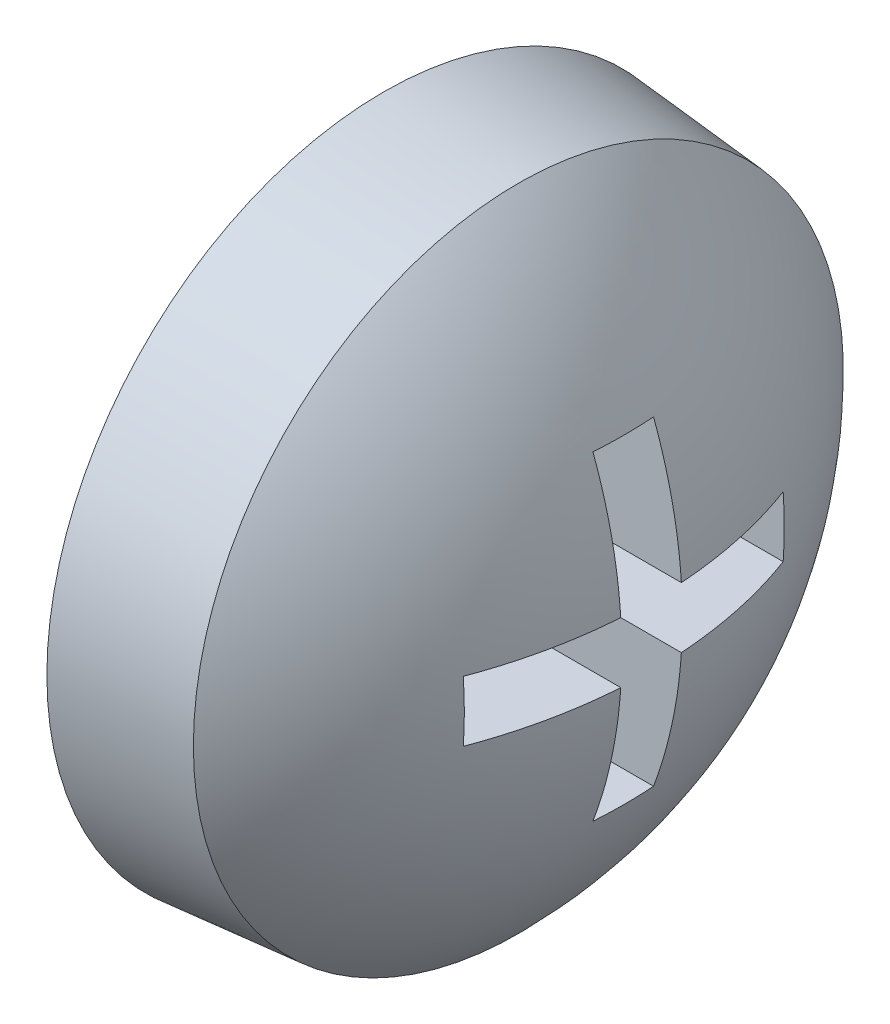
ISO-10303-21;
HEADER;
FILE_DESCRIPTION(('STEP AP214'),'2;1');
FILE_NAME('part.step','',(''),(''),'','','');
FILE_SCHEMA(('AUTOMOTIVE_DESIGN { 1 0 10303 214 1 1 1 1 }'));
ENDSEC;
DATA;
#1=APPLICATION_CONTEXT('core data for automotive mechanical design processes');
#2=APPLICATION_PROTOCOL_DEFINITION('international standard','automotive_design',2000,#1);
#3=PRODUCT_CONTEXT('',#1,'mechanical');
#4=PRODUCT('Part','Part','',(#3));
#5=PRODUCT_RELATED_PRODUCT_CATEGORY('part','',(#4));
#6=PRODUCT_DEFINITION_FORMATION('','',#4);
#7=PRODUCT_DEFINITION_CONTEXT('part definition',#1,'design');
#8=PRODUCT_DEFINITION('design','',#6,#7);
#9=PRODUCT_DEFINITION_SHAPE('','',#8);
#10=(LENGTH_UNIT() NAMED_UNIT(*) SI_UNIT(.MILLI.,.METRE.));
#11=(NAMED_UNIT(*) PLANE_ANGLE_UNIT() SI_UNIT($,.RADIAN.));
#12=(NAMED_UNIT(*) SI_UNIT($,.STERADIAN.) SOLID_ANGLE_UNIT());
#13=UNCERTAINTY_MEASURE_WITH_UNIT(LENGTH_MEASURE(1.E-05),#10,'distance_accuracy_value','');
#14=(GEOMETRIC_REPRESENTATION_CONTEXT(3) GLOBAL_UNCERTAINTY_ASSIGNED_CONTEXT((#13)) GLOBAL_UNIT_ASSIGNED_CONTEXT((#10,
#11,#12)) REPRESENTATION_CONTEXT('',''));
#15=CARTESIAN_POINT('',(0.,0.,0.));
#16=DIRECTION('',(0.,0.,1.));
#17=DIRECTION('',(1.,0.,0.));
#18=AXIS2_PLACEMENT_3D('',#15,#16,#17);
#19=CARTESIAN_POINT('',(215.733333333333,-6.9,10.));
#20=DIRECTION('',(1.,0.,0.));
#21=DIRECTION('',(0.,0.,-1.));
#22=AXIS2_PLACEMENT_3D('',#19,#20,#21);
#23=PLANE('',#22);
#24=DIRECTION('',(0.,0.,1.));
#25=VECTOR('',#24,1.);
#26=CARTESIAN_POINT('',(215.733333333333,-7.85,10.));
#27=LINE('',#26,#25);
#28=CARTESIAN_POINT('',(215.733333333333,-7.85,9.82));
#29=VERTEX_POINT('',#28);
#30=CARTESIAN_POINT('',(215.733333333333,-7.85,10.18));
#31=VERTEX_POINT('',#30);
#32=EDGE_CURVE('E293',#29,#31,#27,.T.);
#33=ORIENTED_EDGE('',*,*,#32,.F.);
#34=DIRECTION('',(0.,1.,0.));
#35=VECTOR('',#34,1.);
#36=CARTESIAN_POINT('',(215.733333333333,-6.9,9.82));
#37=LINE('',#36,#35);
#38=CARTESIAN_POINT('',(215.733333333333,-7.08,9.82));
#39=VERTEX_POINT('',#38);
#40=EDGE_CURVE('E298',#39,#29,#37,.F.);
#41=ORIENTED_EDGE('',*,*,#40,.F.);
#42=DIRECTION('',(0.,0.,1.));
#43=VECTOR('',#42,1.);
#44=CARTESIAN_POINT('',(215.733333333333,-7.08,10.));
#45=LINE('',#44,#43);
#46=CARTESIAN_POINT('',(215.733333333333,-7.08,9.05));
#47=VERTEX_POINT('',#46);
#48=EDGE_CURVE('E303',#47,#39,#45,.T.);
#49=ORIENTED_EDGE('',*,*,#48,.F.);
#50=DIRECTION('',(0.,1.,0.));
#51=VECTOR('',#50,1.);
#52=CARTESIAN_POINT('',(215.733333333333,-6.9,9.05));
#53=LINE('',#52,#51);
#54=CARTESIAN_POINT('',(215.733333333333,-6.72,9.05));
#55=VERTEX_POINT('',#54);
#56=EDGE_CURVE('E308',#55,#47,#53,.F.);
#57=ORIENTED_EDGE('',*,*,#56,.F.);
#58=DIRECTION('',(0.,0.,-1.));
#59=VECTOR('',#58,1.);
#60=CARTESIAN_POINT('',(215.733333333333,-6.72,10.));
#61=LINE('',#60,#59);
#62=CARTESIAN_POINT('',(215.733333333333,-6.72,9.82));
#63=VERTEX_POINT('',#62);
#64=EDGE_CURVE('E313',#63,#55,#61,.T.);
#65=ORIENTED_EDGE('',*,*,#64,.F.);
#66=DIRECTION('',(0.,1.,0.));
#67=VECTOR('',#66,1.);
#68=CARTESIAN_POINT('',(215.733333333333,-6.9,9.82));
#69=LINE('',#68,#67);
#70=CARTESIAN_POINT('',(215.733333333333,-5.95,9.82));
#71=VERTEX_POINT('',#70);
#72=EDGE_CURVE('E318',#71,#63,#69,.F.);
#73=ORIENTED_EDGE('',*,*,#72,.F.);
#74=DIRECTION('',(0.,0.,1.));
#75=VECTOR('',#74,1.);
#76=CARTESIAN_POINT('',(215.733333333333,-5.95,10.));
#77=LINE('',#76,#75);
#78=CARTESIAN_POINT('',(215.733333333333,-5.95,10.18));
#79=VERTEX_POINT('',#78);
#80=EDGE_CURVE('E267',#71,#79,#77,.T.);
#81=ORIENTED_EDGE('',*,*,#80,.T.);
#82=DIRECTION('',(0.,1.,0.));
#83=VECTOR('',#82,1.);
#84=CARTESIAN_POINT('',(215.733333333333,-6.9,10.18));
#85=LINE('',#84,#83);
#86=CARTESIAN_POINT('',(215.733333333333,-6.72,10.18));
#87=VERTEX_POINT('',#86);
#88=EDGE_CURVE('E264',#87,#79,#85,.T.);
#89=ORIENTED_EDGE('',*,*,#88,.F.);
#90=DIRECTION('',(0.,0.,-1.));
#91=VECTOR('',#90,1.);
#92=CARTESIAN_POINT('',(215.733333333333,-6.72,10.));
#93=LINE('',#92,#91);
#94=CARTESIAN_POINT('',(215.733333333333,-6.72,10.95));
#95=VERTEX_POINT('',#94);
#96=EDGE_CURVE('E260',#95,#87,#93,.T.);
#97=ORIENTED_EDGE('',*,*,#96,.F.);
#98=DIRECTION('',(0.,1.,0.));
#99=VECTOR('',#98,1.);
#100=CARTESIAN_POINT('',(215.733333333333,-6.9,10.95));
#101=LINE('',#100,#99);
#102=CARTESIAN_POINT('',(215.733333333333,-7.08,10.95));
#103=VERTEX_POINT('',#102);
#104=EDGE_CURVE('E231',#95,#103,#101,.F.);
#105=ORIENTED_EDGE('',*,*,#104,.T.);
#106=DIRECTION('',(0.,0.,1.));
#107=VECTOR('',#106,1.);
#108=CARTESIAN_POINT('',(215.733333333333,-7.08,10.));
#109=LINE('',#108,#107);
#110=CARTESIAN_POINT('',(215.733333333333,-7.08,10.18));
#111=VERTEX_POINT('',#110);
#112=EDGE_CURVE('E278',#111,#103,#109,.T.);
#113=ORIENTED_EDGE('',*,*,#112,.F.);
#114=DIRECTION('',(0.,1.,0.));
#115=VECTOR('',#114,1.);
#116=CARTESIAN_POINT('',(215.733333333333,-6.9,10.18));
#117=LINE('',#116,#115);
#118=EDGE_CURVE('E288',#31,#111,#117,.T.);
#119=ORIENTED_EDGE('',*,*,#118,.F.);
#120=EDGE_LOOP('',(#33,#41,#49,#57,#65,#73,#81,#89,#97,#105,#113,#119));
#121=FACE_BOUND('',#120,.T.);
#122=ADVANCED_FACE('F17',(#121),#23,.T.);
#123=CARTESIAN_POINT('',(216.333333333333,-6.72,10.));
#124=DIRECTION('',(0.,-1.,0.));
#125=DIRECTION('',(0.,0.,-1.));
#126=AXIS2_PLACEMENT_3D('',#123,#124,#125);
#127=PLANE('',#126);
#128=DIRECTION('',(1.,0.,0.));
#129=VECTOR('',#128,1.);
#130=CARTESIAN_POINT('',(216.333333333333,-6.72,10.95));
#131=LINE('',#130,#129);
#132=CARTESIAN_POINT('',(216.756237856524,-6.72,10.9500000000001));
#133=VERTEX_POINT('',#132);
#134=EDGE_CURVE('E89',#133,#95,#131,.F.);
#135=ORIENTED_EDGE('',*,*,#134,.T.);
#136=ORIENTED_EDGE('',*,*,#96,.T.);
#137=DIRECTION('',(-1.,0.,0.));
#138=VECTOR('',#137,1.);
#139=CARTESIAN_POINT('',(216.333333333333,-6.72,10.18));
#140=LINE('',#139,#138);
#141=CARTESIAN_POINT('',(216.921430903127,-6.71999999999999,10.18));
#142=VERTEX_POINT('',#141);
#143=EDGE_CURVE('E224',#142,#87,#140,.T.);
#144=ORIENTED_EDGE('',*,*,#143,.F.);
#145=CARTESIAN_POINT('',(216.756237856524,-6.72,10.9500000000001));
#146=CARTESIAN_POINT('',(216.767782870718,-6.72,10.9189995540507));
#147=CARTESIAN_POINT('',(216.778762253102,-6.72,10.8877884938069));
#148=CARTESIAN_POINT('',(216.79953545164,-6.72,10.825110453647));
#149=CARTESIAN_POINT('',(216.809333758651,-6.72,10.7936449620742));
#150=CARTESIAN_POINT('',(216.827757299291,-6.72,10.7304618501357));
#151=CARTESIAN_POINT('',(216.83638553892,-6.72,10.6987451062673));
#152=CARTESIAN_POINT('',(216.852477288087,-6.72,10.6350619663156));
#153=CARTESIAN_POINT('',(216.859942316909,-6.72,10.6030959541243));
#154=CARTESIAN_POINT('',(216.873711495295,-6.72,10.5389148788569));
#155=CARTESIAN_POINT('',(216.88001564486,-6.72,10.5066998157809));
#156=CARTESIAN_POINT('',(216.891462392226,-6.72,10.4420201537525));
#157=CARTESIAN_POINT('',(216.896603446971,-6.72,10.4095552817086));
#158=CARTESIAN_POINT('',(216.905718495644,-6.72,10.3443751591894));
#159=CARTESIAN_POINT('',(216.909689388573,-6.72,10.3116594750373));
#160=CARTESIAN_POINT('',(216.916454375482,-6.72,10.2459761632456));
#161=CARTESIAN_POINT('',(216.919243763301,-6.72,10.2130080508538));
#162=CARTESIAN_POINT('',(216.921430903127,-6.72,10.18));
#163=B_SPLINE_CURVE_WITH_KNOTS('',3,(#145,#146,#147,#148,#149,#150,#151,#152,#153,#154,#155,
#156,#157,#158,#159,#160,#161,#162),.UNSPECIFIED.,.F.,.F.,(4,2,2,2,2,2,2,2,4),(0.,
0.0992357442434492,0.198081387639303,0.296668072480549,0.395124892694158,0.49358171290778,
0.592168397749024,0.691014041144897,0.790249785388334),.UNSPECIFIED.);
#164=EDGE_CURVE('E20',#133,#142,#163,.T.);
#165=ORIENTED_EDGE('',*,*,#164,.F.);
#166=EDGE_LOOP('',(#135,#136,#144,#165));
#167=FACE_BOUND('',#166,.T.);
#168=ADVANCED_FACE('F221',(#167),#127,.T.);
#169=CARTESIAN_POINT('',(216.333333333333,-6.9,10.18));
#170=DIRECTION('',(0.,0.,-1.));
#171=DIRECTION('',(-1.,0.,0.));
#172=AXIS2_PLACEMENT_3D('',#169,#170,#171);
#173=PLANE('',#172);
#174=ORIENTED_EDGE('',*,*,#88,.T.);
#175=DIRECTION('',(1.,0.,0.));
#176=VECTOR('',#175,1.);
#177=CARTESIAN_POINT('',(216.333333333333,-5.95,10.18));
#178=LINE('',#177,#176);
#179=CARTESIAN_POINT('',(216.756237856524,-5.95,10.18));
#180=VERTEX_POINT('',#179);
#181=EDGE_CURVE('E324',#79,#180,#178,.T.);
#182=ORIENTED_EDGE('',*,*,#181,.T.);
#183=CARTESIAN_POINT('',(216.921430903127,-6.71999999999997,10.18));
#184=CARTESIAN_POINT('',(216.915776724439,-6.63440991744415,10.18));
#185=CARTESIAN_POINT('',(216.906045237038,-6.54909652262228,10.18));
#186=CARTESIAN_POINT('',(216.878678119522,-6.38034093840227,10.18));
#187=CARTESIAN_POINT('',(216.861096565483,-6.296889980518,10.18));
#188=CARTESIAN_POINT('',(216.816367435921,-6.12495750840946,10.18));
#189=CARTESIAN_POINT('',(216.788531372825,-6.03665468899643,10.18));
#190=CARTESIAN_POINT('',(216.756237856524,-5.94999999999986,10.18));
#191=B_SPLINE_CURVE_WITH_KNOTS('',3,(#183,#184,#185,#186,#187,#188,#189,#190),.UNSPECIFIED.,.F.,
.F.,(4,2,2,4),(0.,0.25722165882936,0.512698117737386,0.789983486231737),.UNSPECIFIED.);
#192=EDGE_CURVE('E213',#142,#180,#191,.T.);
#193=ORIENTED_EDGE('',*,*,#192,.F.);
#194=ORIENTED_EDGE('',*,*,#143,.T.);
#195=EDGE_LOOP('',(#174,#182,#193,#194));
#196=FACE_BOUND('',#195,.T.);
#197=ADVANCED_FACE('F204',(#196),#173,.T.);
#198=CARTESIAN_POINT('',(216.333333333333,-5.95,10.));
#199=DIRECTION('',(0.,1.,0.));
#200=DIRECTION('',(0.,0.,1.));
#201=AXIS2_PLACEMENT_3D('',#198,#199,#200);
#202=PLANE('',#201);
#203=ORIENTED_EDGE('',*,*,#181,.F.);
#204=ORIENTED_EDGE('',*,*,#80,.F.);
#205=DIRECTION('',(1.,0.,0.));
#206=VECTOR('',#205,1.);
#207=CARTESIAN_POINT('',(216.333333333333,-5.95,9.82));
#208=LINE('',#207,#206);
#209=CARTESIAN_POINT('',(216.756237856524,-5.94999999999993,9.82));
#210=VERTEX_POINT('',#209);
#211=EDGE_CURVE('E320',#210,#71,#208,.F.);
#212=ORIENTED_EDGE('',*,*,#211,.F.);
#213=CARTESIAN_POINT('',(216.756237856524,-5.95,10.18));
#214=CARTESIAN_POINT('',(216.760466252223,-5.94999999999998,10.12));
#215=CARTESIAN_POINT('',(216.762580450072,-5.94999999999998,10.06));
#216=CARTESIAN_POINT('',(216.762580450072,-5.95000000000002,9.93999999999995));
#217=CARTESIAN_POINT('',(216.760466252223,-5.95000000000006,9.87999999999993));
#218=CARTESIAN_POINT('',(216.756237856524,-5.95000000000011,9.81999999999991));
#219=B_SPLINE_CURVE_WITH_KNOTS('',3,(#213,#214,#215,#216,#217,#218),.UNSPECIFIED.,.F.,.F.,(4,2,
4),(0.,0.180111711148749,0.360223422297499),.UNSPECIFIED.);
#220=EDGE_CURVE('E207',#180,#210,#219,.T.);
#221=ORIENTED_EDGE('',*,*,#220,.F.);
#222=EDGE_LOOP('',(#203,#204,#212,#221));
#223=FACE_BOUND('',#222,.T.);
#224=ADVANCED_FACE('F199',(#223),#202,.F.);
#225=CARTESIAN_POINT('',(216.333333333333,-6.9,9.82));
#226=DIRECTION('',(0.,0.,1.));
#227=DIRECTION('',(1.,0.,0.));
#228=AXIS2_PLACEMENT_3D('',#225,#226,#227);
#229=PLANE('',#228);
#230=ORIENTED_EDGE('',*,*,#72,.T.);
#231=DIRECTION('',(1.,0.,0.));
#232=VECTOR('',#231,1.);
#233=CARTESIAN_POINT('',(216.333333333333,-6.72,9.82));
#234=LINE('',#233,#232);
#235=CARTESIAN_POINT('',(216.921430903127,-6.72,9.81999999999999));
#236=VERTEX_POINT('',#235);
#237=EDGE_CURVE('E315',#236,#63,#234,.F.);
#238=ORIENTED_EDGE('',*,*,#237,.F.);
#239=CARTESIAN_POINT('',(216.756237856524,-5.94999999999985,9.82));
#240=CARTESIAN_POINT('',(216.767782870718,-5.98100044594928,9.82));
#241=CARTESIAN_POINT('',(216.778762253102,-6.01221150619315,9.82));
#242=CARTESIAN_POINT('',(216.79953545164,-6.07488954635304,9.82));
#243=CARTESIAN_POINT('',(216.809333758651,-6.10635503792583,9.82));
#244=CARTESIAN_POINT('',(216.827757299291,-6.16953814986429,9.82));
#245=CARTESIAN_POINT('',(216.83638553892,-6.20125489373265,9.82));
#246=CARTESIAN_POINT('',(216.852477288087,-6.2649380336844,9.82));
#247=CARTESIAN_POINT('',(216.859942316909,-6.29690404587572,9.82));
#248=CARTESIAN_POINT('',(216.873711495295,-6.36108512114308,9.82));
#249=CARTESIAN_POINT('',(216.88001564486,-6.39330018421912,9.82));
#250=CARTESIAN_POINT('',(216.891462392226,-6.45797984624754,9.82));
#251=CARTESIAN_POINT('',(216.896603446971,-6.49044471829137,9.82));
#252=CARTESIAN_POINT('',(216.905718495644,-6.55562484081063,9.82));
#253=CARTESIAN_POINT('',(216.909689388573,-6.58834052496273,9.82));
#254=CARTESIAN_POINT('',(216.916454375482,-6.65402383675436,9.82));
#255=CARTESIAN_POINT('',(216.919243763301,-6.68699194914619,9.82));
#256=CARTESIAN_POINT('',(216.921430903127,-6.71999999999998,9.82));
#257=B_SPLINE_CURVE_WITH_KNOTS('',3,(#239,#240,#241,#242,#243,#244,#245,#246,#247,#248,#249,
#250,#251,#252,#253,#254,#255,#256),.UNSPECIFIED.,.F.,.F.,(4,2,2,2,2,2,2,2,4),(0.,
0.0992357442434457,0.198081387639302,0.296668072480548,0.395124892694157,0.493581712907779,
0.592168397749023,0.691014041144896,0.790249785388332),.UNSPECIFIED.);
#258=EDGE_CURVE('E184',#210,#236,#257,.T.);
#259=ORIENTED_EDGE('',*,*,#258,.F.);
#260=ORIENTED_EDGE('',*,*,#211,.T.);
#261=EDGE_LOOP('',(#230,#238,#259,#260));
#262=FACE_BOUND('',#261,.T.);
#263=ADVANCED_FACE('F194',(#262),#229,.T.);
#264=CARTESIAN_POINT('',(216.333333333333,-6.72,10.));
#265=DIRECTION('',(0.,-1.,0.));
#266=DIRECTION('',(0.,0.,-1.));
#267=AXIS2_PLACEMENT_3D('',#264,#265,#266);
#268=PLANE('',#267);
#269=DIRECTION('',(1.,0.,0.));
#270=VECTOR('',#269,1.);
#271=CARTESIAN_POINT('',(216.333333333333,-6.72,9.05));
#272=LINE('',#271,#270);
#273=CARTESIAN_POINT('',(216.756237856524,-6.72,9.05));
#274=VERTEX_POINT('',#273);
#275=EDGE_CURVE('E310',#274,#55,#272,.F.);
#276=ORIENTED_EDGE('',*,*,#275,.F.);
#277=CARTESIAN_POINT('',(216.921430903127,-6.72,9.81999999999998));
#278=CARTESIAN_POINT('',(216.915776724439,-6.72,9.73440991744416));
#279=CARTESIAN_POINT('',(216.906045237038,-6.72,9.64909652262228));
#280=CARTESIAN_POINT('',(216.878678119522,-6.72,9.48034093840228));
#281=CARTESIAN_POINT('',(216.861096565483,-6.72,9.396889980518));
#282=CARTESIAN_POINT('',(216.816367435921,-6.72,9.22495750840947));
#283=CARTESIAN_POINT('',(216.788531372825,-6.72,9.13665468899643));
#284=CARTESIAN_POINT('',(216.756237856524,-6.72,9.04999999999986));
#285=B_SPLINE_CURVE_WITH_KNOTS('',3,(#277,#278,#279,#280,#281,#282,#283,#284),.UNSPECIFIED.,.F.,
.F.,(4,2,2,4),(0.,0.257221658829358,0.512698117737381,0.789983486231737),.UNSPECIFIED.);
#286=EDGE_CURVE('E176',#236,#274,#285,.T.);
#287=ORIENTED_EDGE('',*,*,#286,.F.);
#288=ORIENTED_EDGE('',*,*,#237,.T.);
#289=ORIENTED_EDGE('',*,*,#64,.T.);
#290=EDGE_LOOP('',(#276,#287,#288,#289));
#291=FACE_BOUND('',#290,.T.);
#292=ADVANCED_FACE('F191',(#291),#268,.T.);
#293=CARTESIAN_POINT('',(216.333333333333,-6.9,9.05));
#294=DIRECTION('',(0.,0.,1.));
#295=DIRECTION('',(1.,0.,0.));
#296=AXIS2_PLACEMENT_3D('',#293,#294,#295);
#297=PLANE('',#296);
#298=DIRECTION('',(1.,0.,0.));
#299=VECTOR('',#298,1.);
#300=CARTESIAN_POINT('',(216.333333333333,-7.08,9.05));
#301=LINE('',#300,#299);
#302=CARTESIAN_POINT('',(216.756237856524,-7.08,9.04999999999993));
#303=VERTEX_POINT('',#302);
#304=EDGE_CURVE('E305',#303,#47,#301,.F.);
#305=ORIENTED_EDGE('',*,*,#304,.F.);
#306=CARTESIAN_POINT('',(216.756237856524,-7.08,9.05));
#307=CARTESIAN_POINT('',(216.762580450072,-6.99011174581231,9.05));
#308=CARTESIAN_POINT('',(216.762580450072,-6.9,9.05));
#309=B_SPLINE_CURVE_WITH_KNOTS('',2,(#306,#307,#308),.UNSPECIFIED.,.F.,.F.,(3,3),(0.,1.),.UNSPECIFIED.);
#310=CARTESIAN_POINT('',(216.762580450072,-6.9,9.05));
#311=VERTEX_POINT('',#310);
#312=EDGE_CURVE('E175',#311,#303,#309,.F.);
#313=ORIENTED_EDGE('',*,*,#312,.F.);
#314=CARTESIAN_POINT('',(216.762580450072,-6.9,9.05));
#315=CARTESIAN_POINT('',(216.762580450072,-6.80988825418735,9.05));
#316=CARTESIAN_POINT('',(216.756237856524,-6.72,9.05));
#317=B_SPLINE_CURVE_WITH_KNOTS('',2,(#314,#315,#316),.UNSPECIFIED.,.F.,.F.,(3,3),(0.,1.),.UNSPECIFIED.);
#318=EDGE_CURVE('E183',#274,#311,#317,.F.);
#319=ORIENTED_EDGE('',*,*,#318,.F.);
#320=ORIENTED_EDGE('',*,*,#275,.T.);
#321=ORIENTED_EDGE('',*,*,#56,.T.);
#322=EDGE_LOOP('',(#305,#313,#319,#320,#321));
#323=FACE_BOUND('',#322,.T.);
#324=ADVANCED_FACE('F164',(#323),#297,.T.);
#325=CARTESIAN_POINT('',(216.333333333333,-7.08,10.));
#326=DIRECTION('',(0.,1.,0.));
#327=DIRECTION('',(0.,0.,1.));
#328=AXIS2_PLACEMENT_3D('',#325,#326,#327);
#329=PLANE('',#328);
#330=ORIENTED_EDGE('',*,*,#304,.T.);
#331=ORIENTED_EDGE('',*,*,#48,.T.);
#332=DIRECTION('',(1.,0.,0.));
#333=VECTOR('',#332,1.);
#334=CARTESIAN_POINT('',(216.333333333333,-7.08,9.82));
#335=LINE('',#334,#333);
#336=CARTESIAN_POINT('',(216.921430903127,-7.08000000000001,9.82));
#337=VERTEX_POINT('',#336);
#338=EDGE_CURVE('E300',#337,#39,#335,.F.);
#339=ORIENTED_EDGE('',*,*,#338,.F.);
#340=CARTESIAN_POINT('',(216.756237856524,-7.08,9.04999999999985));
#341=CARTESIAN_POINT('',(216.767782870718,-7.08,9.08100044594927));
#342=CARTESIAN_POINT('',(216.778762253102,-7.08,9.11221150619314));
#343=CARTESIAN_POINT('',(216.79953545164,-7.08,9.17488954635303));
#344=CARTESIAN_POINT('',(216.809333758651,-7.08,9.20635503792583));
#345=CARTESIAN_POINT('',(216.827757299291,-7.08,9.26953814986429));
#346=CARTESIAN_POINT('',(216.83638553892,-7.08,9.30125489373265));
#347=CARTESIAN_POINT('',(216.852477288087,-7.08,9.3649380336844));
#348=CARTESIAN_POINT('',(216.859942316909,-7.08,9.39690404587572));
#349=CARTESIAN_POINT('',(216.873711495295,-7.08,9.46108512114308));
#350=CARTESIAN_POINT('',(216.88001564486,-7.08,9.49330018421912));
#351=CARTESIAN_POINT('',(216.891462392226,-7.08,9.55797984624754));
#352=CARTESIAN_POINT('',(216.896603446971,-7.08,9.59044471829137));
#353=CARTESIAN_POINT('',(216.905718495644,-7.08,9.65562484081063));
#354=CARTESIAN_POINT('',(216.909689388573,-7.08,9.68834052496273));
#355=CARTESIAN_POINT('',(216.916454375482,-7.08,9.75402383675436));
#356=CARTESIAN_POINT('',(216.919243763301,-7.08,9.78699194914619));
#357=CARTESIAN_POINT('',(216.921430903127,-7.08,9.81999999999998));
#358=B_SPLINE_CURVE_WITH_KNOTS('',3,(#340,#341,#342,#343,#344,#345,#346,#347,#348,#349,#350,
#351,#352,#353,#354,#355,#356,#357),.UNSPECIFIED.,.F.,.F.,(4,2,2,2,2,2,2,2,4),(0.,
0.0992357442434492,0.198081387639303,0.296668072480552,0.395124892694159,0.493581712907782,
0.592168397749026,0.691014041144899,0.790249785388335),.UNSPECIFIED.);
#359=EDGE_CURVE('E168',#303,#337,#358,.T.);
#360=ORIENTED_EDGE('',*,*,#359,.F.);
#361=EDGE_LOOP('',(#330,#331,#339,#360));
#362=FACE_BOUND('',#361,.T.);
#363=ADVANCED_FACE('F159',(#362),#329,.T.);
#364=CARTESIAN_POINT('',(216.333333333333,-6.9,9.82));
#365=DIRECTION('',(0.,0.,1.));
#366=DIRECTION('',(1.,0.,0.));
#367=AXIS2_PLACEMENT_3D('',#364,#365,#366);
#368=PLANE('',#367);
#369=ORIENTED_EDGE('',*,*,#40,.T.);
#370=DIRECTION('',(1.,0.,0.));
#371=VECTOR('',#370,1.);
#372=CARTESIAN_POINT('',(216.333333333333,-7.85,9.82));
#373=LINE('',#372,#371);
#374=CARTESIAN_POINT('',(216.756237856524,-7.85,9.81999999999998));
#375=VERTEX_POINT('',#374);
#376=EDGE_CURVE('E295',#375,#29,#373,.F.);
#377=ORIENTED_EDGE('',*,*,#376,.F.);
#378=CARTESIAN_POINT('',(216.921430903127,-7.08000000000002,9.82));
#379=CARTESIAN_POINT('',(216.915776724439,-7.16559008255585,9.82));
#380=CARTESIAN_POINT('',(216.906045237038,-7.25090347737772,9.82));
#381=CARTESIAN_POINT('',(216.878678119522,-7.41965906159773,9.82));
#382=CARTESIAN_POINT('',(216.861096565483,-7.503110019482,9.82));
#383=CARTESIAN_POINT('',(216.816367435921,-7.67504249159054,9.82));
#384=CARTESIAN_POINT('',(216.788531372825,-7.76334531100357,9.82));
#385=CARTESIAN_POINT('',(216.756237856524,-7.85000000000014,9.82));
#386=B_SPLINE_CURVE_WITH_KNOTS('',3,(#378,#379,#380,#381,#382,#383,#384,#385),.UNSPECIFIED.,.F.,
.F.,(4,2,2,4),(0.,0.257221658829359,0.512698117737383,0.789983486231734),.UNSPECIFIED.);
#387=EDGE_CURVE('E144',#337,#375,#386,.T.);
#388=ORIENTED_EDGE('',*,*,#387,.F.);
#389=ORIENTED_EDGE('',*,*,#338,.T.);
#390=EDGE_LOOP('',(#369,#377,#388,#389));
#391=FACE_BOUND('',#390,.T.);
#392=ADVANCED_FACE('F154',(#391),#368,.T.);
#393=CARTESIAN_POINT('',(216.333333333333,-7.85,10.));
#394=DIRECTION('',(0.,1.,0.));
#395=DIRECTION('',(0.,0.,1.));
#396=AXIS2_PLACEMENT_3D('',#393,#394,#395);
#397=PLANE('',#396);
#398=ORIENTED_EDGE('',*,*,#32,.T.);
#399=DIRECTION('',(-1.,0.,0.));
#400=VECTOR('',#399,1.);
#401=CARTESIAN_POINT('',(216.333333333333,-7.85,10.18));
#402=LINE('',#401,#400);
#403=CARTESIAN_POINT('',(216.756237856524,-7.85000000000008,10.18));
#404=VERTEX_POINT('',#403);
#405=EDGE_CURVE('E290',#404,#31,#402,.T.);
#406=ORIENTED_EDGE('',*,*,#405,.F.);
#407=CARTESIAN_POINT('',(216.756237856524,-7.85,9.81999999999997));
#408=CARTESIAN_POINT('',(216.760466252223,-7.85000000000001,9.87999999999999));
#409=CARTESIAN_POINT('',(216.762580450072,-7.85000000000001,9.94000000000001));
#410=CARTESIAN_POINT('',(216.762580450072,-7.84999999999999,10.0600000000001));
#411=CARTESIAN_POINT('',(216.760466252223,-7.84999999999997,10.1200000000001));
#412=CARTESIAN_POINT('',(216.756237856524,-7.84999999999994,10.1800000000001));
#413=B_SPLINE_CURVE_WITH_KNOTS('',3,(#407,#408,#409,#410,#411,#412),.UNSPECIFIED.,.F.,.F.,(4,2,
4),(0.,0.18011171114875,0.360223422297499),.UNSPECIFIED.);
#414=EDGE_CURVE('E137',#375,#404,#413,.T.);
#415=ORIENTED_EDGE('',*,*,#414,.F.);
#416=ORIENTED_EDGE('',*,*,#376,.T.);
#417=EDGE_LOOP('',(#398,#406,#415,#416));
#418=FACE_BOUND('',#417,.T.);
#419=ADVANCED_FACE('F151',(#418),#397,.T.);
#420=CARTESIAN_POINT('',(216.333333333333,-6.9,10.18));
#421=DIRECTION('',(0.,0.,-1.));
#422=DIRECTION('',(-1.,0.,0.));
#423=AXIS2_PLACEMENT_3D('',#420,#421,#422);
#424=PLANE('',#423);
#425=ORIENTED_EDGE('',*,*,#118,.T.);
#426=DIRECTION('',(1.,0.,0.));
#427=VECTOR('',#426,1.);
#428=CARTESIAN_POINT('',(216.333333333333,-7.08,10.18));
#429=LINE('',#428,#427);
#430=CARTESIAN_POINT('',(216.921430903127,-7.08,10.18));
#431=VERTEX_POINT('',#430);
#432=EDGE_CURVE('E280',#431,#111,#429,.F.);
#433=ORIENTED_EDGE('',*,*,#432,.F.);
#434=CARTESIAN_POINT('',(216.756237856524,-7.85000000000015,10.18));
#435=CARTESIAN_POINT('',(216.767782870718,-7.81899955405073,10.18));
#436=CARTESIAN_POINT('',(216.778762253102,-7.78778849380687,10.18));
#437=CARTESIAN_POINT('',(216.79953545164,-7.72511045364697,10.18));
#438=CARTESIAN_POINT('',(216.809333758651,-7.69364496207417,10.18));
#439=CARTESIAN_POINT('',(216.827757299291,-7.63046185013571,10.18));
#440=CARTESIAN_POINT('',(216.83638553892,-7.59874510626735,10.18));
#441=CARTESIAN_POINT('',(216.852477288087,-7.5350619663156,10.18));
#442=CARTESIAN_POINT('',(216.859942316909,-7.50309595412428,10.18));
#443=CARTESIAN_POINT('',(216.873711495295,-7.43891487885692,10.18));
#444=CARTESIAN_POINT('',(216.88001564486,-7.40669981578088,10.18));
#445=CARTESIAN_POINT('',(216.891462392226,-7.34202015375246,10.18));
#446=CARTESIAN_POINT('',(216.896603446971,-7.30955528170863,10.18));
#447=CARTESIAN_POINT('',(216.905718495644,-7.24437515918937,10.18));
#448=CARTESIAN_POINT('',(216.909689388573,-7.21165947503727,10.18));
#449=CARTESIAN_POINT('',(216.916454375482,-7.14597616324564,10.18));
#450=CARTESIAN_POINT('',(216.919243763301,-7.11300805085381,10.18));
#451=CARTESIAN_POINT('',(216.921430903127,-7.08000000000002,10.18));
#452=B_SPLINE_CURVE_WITH_KNOTS('',3,(#434,#435,#436,#437,#438,#439,#440,#441,#442,#443,#444,
#445,#446,#447,#448,#449,#450,#451),.UNSPECIFIED.,.F.,.F.,(4,2,2,2,2,2,2,2,4),(0.,
0.0992357442434476,0.198081387639303,0.29666807248055,0.395124892694159,0.493581712907781,
0.592168397749024,0.691014041144898,0.790249785388334),.UNSPECIFIED.);
#453=EDGE_CURVE('E100',#404,#431,#452,.T.);
#454=ORIENTED_EDGE('',*,*,#453,.F.);
#455=ORIENTED_EDGE('',*,*,#405,.T.);
#456=EDGE_LOOP('',(#425,#433,#454,#455));
#457=FACE_BOUND('',#456,.T.);
#458=ADVANCED_FACE('F123',(#457),#424,.T.);
#459=CARTESIAN_POINT('',(216.333333333333,-7.08,10.));
#460=DIRECTION('',(0.,1.,0.));
#461=DIRECTION('',(0.,0.,1.));
#462=AXIS2_PLACEMENT_3D('',#459,#460,#461);
#463=PLANE('',#462);
#464=DIRECTION('',(1.,0.,0.));
#465=VECTOR('',#464,1.);
#466=CARTESIAN_POINT('',(216.333333333333,-7.08,10.95));
#467=LINE('',#466,#465);
#468=CARTESIAN_POINT('',(216.756237856524,-7.08,10.95));
#469=VERTEX_POINT('',#468);
#470=EDGE_CURVE('E40',#103,#469,#467,.T.);
#471=ORIENTED_EDGE('',*,*,#470,.T.);
#472=CARTESIAN_POINT('',(216.921430903127,-7.08,10.18));
#473=CARTESIAN_POINT('',(216.915776724439,-7.08,10.2655900825558));
#474=CARTESIAN_POINT('',(216.906045237038,-7.08,10.3509034773777));
#475=CARTESIAN_POINT('',(216.878678119522,-7.08,10.5196590615977));
#476=CARTESIAN_POINT('',(216.861096565483,-7.08,10.603110019482));
#477=CARTESIAN_POINT('',(216.816367435921,-7.08,10.7750424915905));
#478=CARTESIAN_POINT('',(216.788531372825,-7.08,10.8633453110036));
#479=CARTESIAN_POINT('',(216.756237856524,-7.08,10.9500000000001));
#480=B_SPLINE_CURVE_WITH_KNOTS('',3,(#472,#473,#474,#475,#476,#477,#478,#479),.UNSPECIFIED.,.F.,
.F.,(4,2,2,4),(0.,0.257221658829358,0.512698117737383,0.789983486231735),.UNSPECIFIED.);
#481=EDGE_CURVE('E96',#431,#469,#480,.T.);
#482=ORIENTED_EDGE('',*,*,#481,.F.);
#483=ORIENTED_EDGE('',*,*,#432,.T.);
#484=ORIENTED_EDGE('',*,*,#112,.T.);
#485=EDGE_LOOP('',(#471,#482,#483,#484));
#486=FACE_BOUND('',#485,.T.);
#487=ADVANCED_FACE('F115',(#486),#463,.T.);
#488=CARTESIAN_POINT('',(216.333333333333,-6.9,10.95));
#489=DIRECTION('',(0.,0.,1.));
#490=DIRECTION('',(1.,0.,0.));
#491=AXIS2_PLACEMENT_3D('',#488,#489,#490);
#492=PLANE('',#491);
#493=ORIENTED_EDGE('',*,*,#470,.F.);
#494=ORIENTED_EDGE('',*,*,#104,.F.);
#495=ORIENTED_EDGE('',*,*,#134,.F.);
#496=CARTESIAN_POINT('',(216.762580450072,-6.9,10.95));
#497=CARTESIAN_POINT('',(216.762580450072,-6.80988825418735,10.95));
#498=CARTESIAN_POINT('',(216.756237856524,-6.72,10.95));
#499=B_SPLINE_CURVE_WITH_KNOTS('',2,(#496,#497,#498),.UNSPECIFIED.,.F.,.F.,(3,3),(0.,1.),.UNSPECIFIED.);
#500=CARTESIAN_POINT('',(216.762580450072,-6.9,10.95));
#501=VERTEX_POINT('',#500);
#502=EDGE_CURVE('E82',#501,#133,#499,.T.);
#503=ORIENTED_EDGE('',*,*,#502,.F.);
#504=CARTESIAN_POINT('',(216.756237856524,-7.08,10.95));
#505=CARTESIAN_POINT('',(216.762580450072,-6.9901117458123,10.95));
#506=CARTESIAN_POINT('',(216.762580450072,-6.9,10.95));
#507=B_SPLINE_CURVE_WITH_KNOTS('',2,(#504,#505,#506),.UNSPECIFIED.,.F.,.F.,(3,3),(0.,1.),.UNSPECIFIED.);
#508=EDGE_CURVE('E85',#469,#501,#507,.T.);
#509=ORIENTED_EDGE('',*,*,#508,.F.);
#510=EDGE_LOOP('',(#493,#494,#495,#503,#509));
#511=FACE_BOUND('',#510,.T.);
#512=ADVANCED_FACE('F84',(#511),#492,.F.);
#513=CARTESIAN_POINT('',(214.205248953887,-6.9,10.));
#514=DIRECTION('',(1.,0.,0.));
#515=DIRECTION('',(0.,1.,0.));
#516=AXIS2_PLACEMENT_3D('',#513,#514,#515);
#517=SPHERICAL_SURFACE('',#516,2.72808437944638);
#518=CARTESIAN_POINT('',(216.133333333346,-6.9,10.));
#519=DIRECTION('',(-1.,0.,0.));
#520=DIRECTION('',(0.,0.,1.));
#521=AXIS2_PLACEMENT_3D('',#518,#519,#520);
#522=CIRCLE('',#521,1.93000906918229);
#523=CARTESIAN_POINT('',(216.133333333346,-6.90000000000007,11.9300090691823));
#524=VERTEX_POINT('',#523);
#525=EDGE_CURVE('E31',#524,#524,#522,.T.);
#526=ORIENTED_EDGE('',*,*,#525,.F.);
#527=EDGE_LOOP('',(#526));
#528=FACE_BOUND('',#527,.T.);
#529=ORIENTED_EDGE('',*,*,#481,.T.);
#530=ORIENTED_EDGE('',*,*,#508,.T.);
#531=ORIENTED_EDGE('',*,*,#502,.T.);
#532=ORIENTED_EDGE('',*,*,#164,.T.);
#533=ORIENTED_EDGE('',*,*,#192,.T.);
#534=ORIENTED_EDGE('',*,*,#220,.T.);
#535=ORIENTED_EDGE('',*,*,#258,.T.);
#536=ORIENTED_EDGE('',*,*,#286,.T.);
#537=ORIENTED_EDGE('',*,*,#318,.T.);
#538=ORIENTED_EDGE('',*,*,#312,.T.);
#539=ORIENTED_EDGE('',*,*,#359,.T.);
#540=ORIENTED_EDGE('',*,*,#387,.T.);
#541=ORIENTED_EDGE('',*,*,#414,.T.);
#542=ORIENTED_EDGE('',*,*,#453,.T.);
#543=EDGE_LOOP('',(#529,#530,#531,#532,#533,#534,#535,#536,#537,#538,#539,#540,#541,#542));
#544=FACE_BOUND('',#543,.T.);
#545=ADVANCED_FACE('F94',(#528,#544),#517,.T.);
#546=CARTESIAN_POINT('',(215.333333333319,-6.9,10.));
#547=DIRECTION('',(-1.,0.,0.));
#548=DIRECTION('',(0.,0.,1.));
#549=AXIS2_PLACEMENT_3D('',#546,#547,#548);
#550=CONICAL_SURFACE('',#549,2.00000000000756,0.0872664626024547);
#551=CARTESIAN_POINT('',(215.333333333319,-6.9,10.));
#552=DIRECTION('',(-1.,0.,0.));
#553=DIRECTION('',(0.,0.,1.));
#554=AXIS2_PLACEMENT_3D('',#551,#552,#553);
#555=CIRCLE('',#554,2.00000000000756);
#556=CARTESIAN_POINT('',(215.333333333319,-6.9,12.0000000000076));
#557=VERTEX_POINT('',#556);
#558=EDGE_CURVE('E11',#557,#557,#555,.T.);
#559=ORIENTED_EDGE('',*,*,#558,.F.);
#560=EDGE_LOOP('',(#559));
#561=FACE_BOUND('',#560,.T.);
#562=ORIENTED_EDGE('',*,*,#525,.T.);
#563=EDGE_LOOP('',(#562));
#564=FACE_BOUND('',#563,.T.);
#565=ADVANCED_FACE('F402',(#561,#564),#550,.T.);
#566=CARTESIAN_POINT('',(215.333333333333,-6.9,11.));
#567=DIRECTION('',(-1.,0.,0.));
#568=DIRECTION('',(0.,0.,1.));
#569=AXIS2_PLACEMENT_3D('',#566,#567,#568);
#570=PLANE('',#569);
#571=ORIENTED_EDGE('',*,*,#558,.T.);
#572=EDGE_LOOP('',(#571));
#573=FACE_BOUND('',#572,.T.);
#574=ADVANCED_FACE('F400',(#573),#570,.T.);
#575=CLOSED_SHELL('',(#122,#168,#197,#224,#263,#292,#324,#363,#392,#419,#458,#487,#512,#545,
#565,#574));
#576=MANIFOLD_SOLID_BREP('B1',#575);
#577=ADVANCED_BREP_SHAPE_REPRESENTATION('',(#18,#576),#14);
#578=SHAPE_DEFINITION_REPRESENTATION(#9,#577);
ENDSEC;
END-ISO-10303-21;
